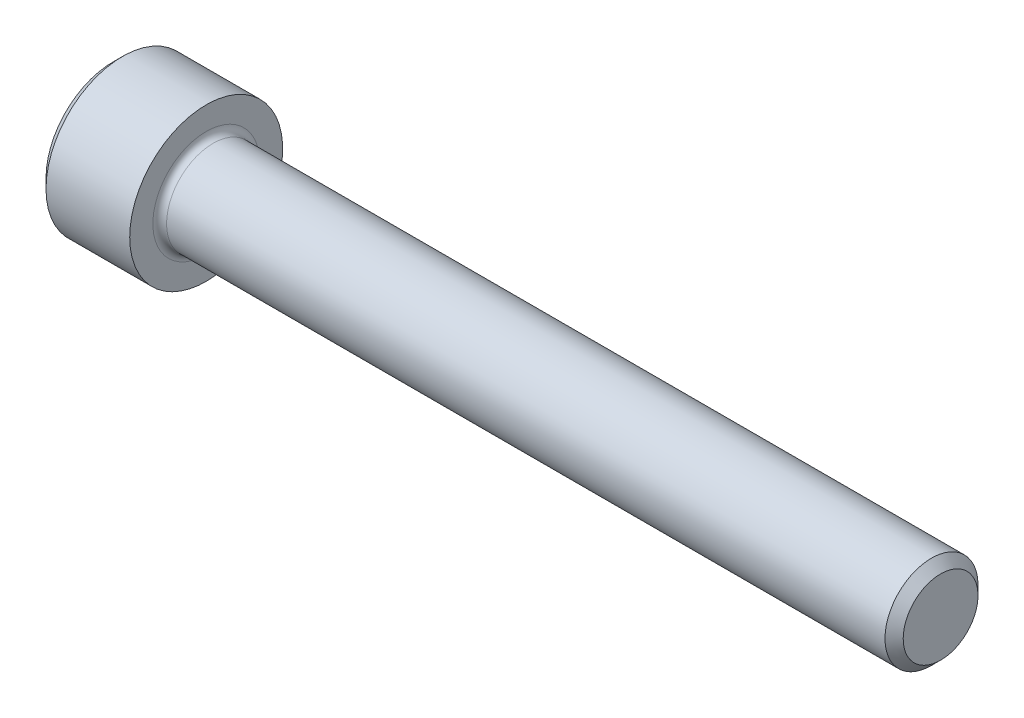
ISO-10303-21;
HEADER;
FILE_DESCRIPTION(('STEP AP214'),'2;1');
FILE_NAME('part.step','',(''),(''),'','','');
FILE_SCHEMA(('AUTOMOTIVE_DESIGN { 1 0 10303 214 1 1 1 1 }'));
ENDSEC;
DATA;
#1=APPLICATION_CONTEXT('core data for automotive mechanical design processes');
#2=APPLICATION_PROTOCOL_DEFINITION('international standard','automotive_design',2000,#1);
#3=PRODUCT_CONTEXT('',#1,'mechanical');
#4=PRODUCT('Part','Part','',(#3));
#5=PRODUCT_RELATED_PRODUCT_CATEGORY('part','',(#4));
#6=PRODUCT_DEFINITION_FORMATION('','',#4);
#7=PRODUCT_DEFINITION_CONTEXT('part definition',#1,'design');
#8=PRODUCT_DEFINITION('design','',#6,#7);
#9=PRODUCT_DEFINITION_SHAPE('','',#8);
#10=(LENGTH_UNIT() NAMED_UNIT(*) SI_UNIT(.MILLI.,.METRE.));
#11=(NAMED_UNIT(*) PLANE_ANGLE_UNIT() SI_UNIT($,.RADIAN.));
#12=(NAMED_UNIT(*) SI_UNIT($,.STERADIAN.) SOLID_ANGLE_UNIT());
#13=UNCERTAINTY_MEASURE_WITH_UNIT(LENGTH_MEASURE(1.E-05),#10,'distance_accuracy_value','');
#14=(GEOMETRIC_REPRESENTATION_CONTEXT(3) GLOBAL_UNCERTAINTY_ASSIGNED_CONTEXT((#13)) GLOBAL_UNIT_ASSIGNED_CONTEXT((#10,
#11,#12)) REPRESENTATION_CONTEXT('',''));
#15=CARTESIAN_POINT('',(0.,0.,0.));
#16=DIRECTION('',(0.,0.,1.));
#17=DIRECTION('',(1.,0.,0.));
#18=AXIS2_PLACEMENT_3D('',#15,#16,#17);
#19=CARTESIAN_POINT('',(2.286,0.,0.));
#20=DIRECTION('',(-1.,0.,0.));
#21=DIRECTION('',(0.,0.,1.));
#22=AXIS2_PLACEMENT_3D('',#19,#20,#21);
#23=CONICAL_SURFACE('',#22,1.98501,1.0471975511966);
#24=CARTESIAN_POINT('',(3.43204605784411,0.,0.));
#25=VERTEX_POINT('',#24);
#26=VERTEX_LOOP('',#25);
#27=FACE_BOUND('',#26,.T.);
#28=CARTESIAN_POINT('',(2.286,0.,0.));
#29=DIRECTION('',(-1.,0.,0.));
#30=DIRECTION('',(0.,0.,1.));
#31=AXIS2_PLACEMENT_3D('',#28,#29,#30);
#32=CIRCLE('',#31,1.98501);
#33=CARTESIAN_POINT('',(2.286,0.,1.98501));
#34=VERTEX_POINT('',#33);
#35=CARTESIAN_POINT('',(2.286,1.71906908676615,0.992505));
#36=VERTEX_POINT('',#35);
#37=EDGE_CURVE('E11',#34,#36,#32,.T.);
#38=ORIENTED_EDGE('',*,*,#37,.T.);
#39=CARTESIAN_POINT('',(2.286,0.,0.));
#40=DIRECTION('',(-1.,0.,0.));
#41=DIRECTION('',(0.,0.,1.));
#42=AXIS2_PLACEMENT_3D('',#39,#40,#41);
#43=CIRCLE('',#42,1.98501);
#44=CARTESIAN_POINT('',(2.286,1.71906908676615,-0.992505));
#45=VERTEX_POINT('',#44);
#46=EDGE_CURVE('E27',#36,#45,#43,.T.);
#47=ORIENTED_EDGE('',*,*,#46,.T.);
#48=CARTESIAN_POINT('',(2.286,0.,0.));
#49=DIRECTION('',(-1.,0.,0.));
#50=DIRECTION('',(0.,0.,1.));
#51=AXIS2_PLACEMENT_3D('',#48,#49,#50);
#52=CIRCLE('',#51,1.98501);
#53=CARTESIAN_POINT('',(2.286,0.,-1.98501));
#54=VERTEX_POINT('',#53);
#55=EDGE_CURVE('E191',#45,#54,#52,.T.);
#56=ORIENTED_EDGE('',*,*,#55,.T.);
#57=CARTESIAN_POINT('',(2.286,0.,0.));
#58=DIRECTION('',(-1.,0.,0.));
#59=DIRECTION('',(0.,0.,1.));
#60=AXIS2_PLACEMENT_3D('',#57,#58,#59);
#61=CIRCLE('',#60,1.98501);
#62=CARTESIAN_POINT('',(2.286,-1.71906908676615,-0.992505));
#63=VERTEX_POINT('',#62);
#64=EDGE_CURVE('E257',#54,#63,#61,.T.);
#65=ORIENTED_EDGE('',*,*,#64,.T.);
#66=CARTESIAN_POINT('',(2.286,0.,0.));
#67=DIRECTION('',(-1.,0.,0.));
#68=DIRECTION('',(0.,0.,1.));
#69=AXIS2_PLACEMENT_3D('',#66,#67,#68);
#70=CIRCLE('',#69,1.98501);
#71=CARTESIAN_POINT('',(2.286,-1.71906908676614,0.992505));
#72=VERTEX_POINT('',#71);
#73=EDGE_CURVE('E260',#63,#72,#70,.T.);
#74=ORIENTED_EDGE('',*,*,#73,.T.);
#75=CARTESIAN_POINT('',(2.286,0.,0.));
#76=DIRECTION('',(-1.,0.,0.));
#77=DIRECTION('',(0.,0.,1.));
#78=AXIS2_PLACEMENT_3D('',#75,#76,#77);
#79=CIRCLE('',#78,1.98501);
#80=EDGE_CURVE('E270',#72,#34,#79,.T.);
#81=ORIENTED_EDGE('',*,*,#80,.T.);
#82=EDGE_LOOP('',(#38,#47,#56,#65,#74,#81));
#83=FACE_BOUND('',#82,.T.);
#84=ADVANCED_FACE('F18',(#27,#83),#23,.F.);
#85=CARTESIAN_POINT('',(2.286,1.14604605784411,1.98501));
#86=DIRECTION('',(-1.,0.,0.));
#87=DIRECTION('',(0.,0.,1.));
#88=AXIS2_PLACEMENT_3D('',#85,#86,#87);
#89=PLANE('',#88);
#90=ORIENTED_EDGE('',*,*,#37,.F.);
#91=DIRECTION('',(0.,1.,0.));
#92=VECTOR('',#91,1.);
#93=CARTESIAN_POINT('',(2.286,-1.14604605784409,1.98501));
#94=LINE('',#93,#92);
#95=CARTESIAN_POINT('',(2.286,1.14604605784411,1.98501));
#96=VERTEX_POINT('',#95);
#97=EDGE_CURVE('E197',#34,#96,#94,.T.);
#98=ORIENTED_EDGE('',*,*,#97,.T.);
#99=DIRECTION('',(0.,-0.5,0.86602540378444));
#100=VECTOR('',#99,1.);
#101=CARTESIAN_POINT('',(2.286,2.29209211568821,0.));
#102=LINE('',#101,#100);
#103=EDGE_CURVE('E224',#36,#96,#102,.T.);
#104=ORIENTED_EDGE('',*,*,#103,.F.);
#105=EDGE_LOOP('',(#90,#98,#104));
#106=FACE_BOUND('',#105,.T.);
#107=ADVANCED_FACE('F20',(#106),#89,.T.);
#108=CARTESIAN_POINT('',(2.286,1.14604605784411,1.98501));
#109=DIRECTION('',(-1.,0.,0.));
#110=DIRECTION('',(0.,0.,1.));
#111=AXIS2_PLACEMENT_3D('',#108,#109,#110);
#112=PLANE('',#111);
#113=ORIENTED_EDGE('',*,*,#46,.F.);
#114=DIRECTION('',(0.,-0.5,0.86602540378444));
#115=VECTOR('',#114,1.);
#116=CARTESIAN_POINT('',(2.286,2.29209211568821,0.));
#117=LINE('',#116,#115);
#118=CARTESIAN_POINT('',(2.286,2.29209211568821,0.));
#119=VERTEX_POINT('',#118);
#120=EDGE_CURVE('E220',#119,#36,#117,.T.);
#121=ORIENTED_EDGE('',*,*,#120,.F.);
#122=DIRECTION('',(0.,-0.5,-0.866025403784438));
#123=VECTOR('',#122,1.);
#124=CARTESIAN_POINT('',(2.286,2.29209211568821,0.));
#125=LINE('',#124,#123);
#126=EDGE_CURVE('E266',#119,#45,#125,.T.);
#127=ORIENTED_EDGE('',*,*,#126,.T.);
#128=EDGE_LOOP('',(#113,#121,#127));
#129=FACE_BOUND('',#128,.T.);
#130=ADVANCED_FACE('F306',(#129),#112,.T.);
#131=CARTESIAN_POINT('',(2.286,1.14604605784411,1.98501));
#132=DIRECTION('',(-1.,0.,0.));
#133=DIRECTION('',(0.,0.,1.));
#134=AXIS2_PLACEMENT_3D('',#131,#132,#133);
#135=PLANE('',#134);
#136=ORIENTED_EDGE('',*,*,#55,.F.);
#137=DIRECTION('',(0.,-0.5,-0.866025403784438));
#138=VECTOR('',#137,1.);
#139=CARTESIAN_POINT('',(2.286,2.29209211568821,0.));
#140=LINE('',#139,#138);
#141=CARTESIAN_POINT('',(2.286,1.1460460578441,-1.98501));
#142=VERTEX_POINT('',#141);
#143=EDGE_CURVE('E263',#45,#142,#140,.T.);
#144=ORIENTED_EDGE('',*,*,#143,.T.);
#145=DIRECTION('',(0.,-1.,0.));
#146=VECTOR('',#145,1.);
#147=CARTESIAN_POINT('',(2.286,1.1460460578441,-1.98501));
#148=LINE('',#147,#146);
#149=EDGE_CURVE('E252',#142,#54,#148,.T.);
#150=ORIENTED_EDGE('',*,*,#149,.T.);
#151=EDGE_LOOP('',(#136,#144,#150));
#152=FACE_BOUND('',#151,.T.);
#153=ADVANCED_FACE('F287',(#152),#135,.T.);
#154=CARTESIAN_POINT('',(2.286,1.14604605784411,1.98501));
#155=DIRECTION('',(-1.,0.,0.));
#156=DIRECTION('',(0.,0.,1.));
#157=AXIS2_PLACEMENT_3D('',#154,#155,#156);
#158=PLANE('',#157);
#159=ORIENTED_EDGE('',*,*,#64,.F.);
#160=DIRECTION('',(0.,-1.,0.));
#161=VECTOR('',#160,1.);
#162=CARTESIAN_POINT('',(2.286,1.1460460578441,-1.98501));
#163=LINE('',#162,#161);
#164=CARTESIAN_POINT('',(2.286,-1.1460460578441,-1.98501));
#165=VERTEX_POINT('',#164);
#166=EDGE_CURVE('E249',#54,#165,#163,.T.);
#167=ORIENTED_EDGE('',*,*,#166,.T.);
#168=DIRECTION('',(0.,0.5,-0.86602540378444));
#169=VECTOR('',#168,1.);
#170=CARTESIAN_POINT('',(2.286,-2.2920921156882,0.));
#171=LINE('',#170,#169);
#172=EDGE_CURVE('E242',#63,#165,#171,.T.);
#173=ORIENTED_EDGE('',*,*,#172,.F.);
#174=EDGE_LOOP('',(#159,#167,#173));
#175=FACE_BOUND('',#174,.T.);
#176=ADVANCED_FACE('F283',(#175),#158,.T.);
#177=CARTESIAN_POINT('',(2.286,1.14604605784411,1.98501));
#178=DIRECTION('',(-1.,0.,0.));
#179=DIRECTION('',(0.,0.,1.));
#180=AXIS2_PLACEMENT_3D('',#177,#178,#179);
#181=PLANE('',#180);
#182=ORIENTED_EDGE('',*,*,#73,.F.);
#183=DIRECTION('',(0.,0.5,-0.86602540378444));
#184=VECTOR('',#183,1.);
#185=CARTESIAN_POINT('',(2.286,-2.2920921156882,0.));
#186=LINE('',#185,#184);
#187=CARTESIAN_POINT('',(2.286,-2.2920921156882,0.));
#188=VERTEX_POINT('',#187);
#189=EDGE_CURVE('E214',#188,#63,#186,.T.);
#190=ORIENTED_EDGE('',*,*,#189,.F.);
#191=DIRECTION('',(0.,-0.5,-0.866025403784438));
#192=VECTOR('',#191,1.);
#193=CARTESIAN_POINT('',(2.286,-1.14604605784409,1.98501));
#194=LINE('',#193,#192);
#195=EDGE_CURVE('E215',#72,#188,#194,.T.);
#196=ORIENTED_EDGE('',*,*,#195,.F.);
#197=EDGE_LOOP('',(#182,#190,#196));
#198=FACE_BOUND('',#197,.T.);
#199=ADVANCED_FACE('F298',(#198),#181,.T.);
#200=CARTESIAN_POINT('',(2.286,1.14604605784411,1.98501));
#201=DIRECTION('',(-1.,0.,0.));
#202=DIRECTION('',(0.,0.,1.));
#203=AXIS2_PLACEMENT_3D('',#200,#201,#202);
#204=PLANE('',#203);
#205=ORIENTED_EDGE('',*,*,#80,.F.);
#206=DIRECTION('',(0.,-0.5,-0.866025403784438));
#207=VECTOR('',#206,1.);
#208=CARTESIAN_POINT('',(2.286,-1.14604605784409,1.98501));
#209=LINE('',#208,#207);
#210=CARTESIAN_POINT('',(2.286,-1.14604605784409,1.98501));
#211=VERTEX_POINT('',#210);
#212=EDGE_CURVE('E155',#211,#72,#209,.T.);
#213=ORIENTED_EDGE('',*,*,#212,.F.);
#214=DIRECTION('',(0.,1.,0.));
#215=VECTOR('',#214,1.);
#216=CARTESIAN_POINT('',(2.286,-1.14604605784409,1.98501));
#217=LINE('',#216,#215);
#218=EDGE_CURVE('E151',#211,#34,#217,.T.);
#219=ORIENTED_EDGE('',*,*,#218,.T.);
#220=EDGE_LOOP('',(#205,#213,#219));
#221=FACE_BOUND('',#220,.T.);
#222=ADVANCED_FACE('F301',(#221),#204,.T.);
#223=CARTESIAN_POINT('',(2.286,2.29209211568821,0.));
#224=DIRECTION('',(0.,0.866025403784438,-0.5));
#225=DIRECTION('',(-1.,0.,0.));
#226=AXIS2_PLACEMENT_3D('',#223,#224,#225);
#227=PLANE('',#226);
#228=DIRECTION('',(0.,-0.5,-0.866025403784438));
#229=VECTOR('',#228,1.);
#230=CARTESIAN_POINT('',(0.,2.29209211568821,0.));
#231=LINE('',#230,#229);
#232=CARTESIAN_POINT('',(0.,2.29209211568821,0.));
#233=VERTEX_POINT('',#232);
#234=CARTESIAN_POINT('',(0.,1.1460460578441,-1.98501));
#235=VERTEX_POINT('',#234);
#236=EDGE_CURVE('E198',#233,#235,#231,.T.);
#237=ORIENTED_EDGE('',*,*,#236,.T.);
#238=DIRECTION('',(-1.,0.,0.));
#239=VECTOR('',#238,1.);
#240=CARTESIAN_POINT('',(2.286,1.1460460578441,-1.98501));
#241=LINE('',#240,#239);
#242=EDGE_CURVE('E256',#142,#235,#241,.T.);
#243=ORIENTED_EDGE('',*,*,#242,.F.);
#244=ORIENTED_EDGE('',*,*,#143,.F.);
#245=ORIENTED_EDGE('',*,*,#126,.F.);
#246=DIRECTION('',(-1.,0.,0.));
#247=VECTOR('',#246,1.);
#248=CARTESIAN_POINT('',(2.286,2.29209211568821,0.));
#249=LINE('',#248,#247);
#250=EDGE_CURVE('E211',#119,#233,#249,.T.);
#251=ORIENTED_EDGE('',*,*,#250,.T.);
#252=EDGE_LOOP('',(#237,#243,#244,#245,#251));
#253=FACE_BOUND('',#252,.T.);
#254=ADVANCED_FACE('F309',(#253),#227,.F.);
#255=CARTESIAN_POINT('',(2.286,1.1460460578441,-1.98501));
#256=DIRECTION('',(0.,0.,-1.));
#257=DIRECTION('',(0.,-1.,0.));
#258=AXIS2_PLACEMENT_3D('',#255,#256,#257);
#259=PLANE('',#258);
#260=DIRECTION('',(0.,-1.,0.));
#261=VECTOR('',#260,1.);
#262=CARTESIAN_POINT('',(0.,1.1460460578441,-1.98501));
#263=LINE('',#262,#261);
#264=CARTESIAN_POINT('',(0.,-1.1460460578441,-1.98501));
#265=VERTEX_POINT('',#264);
#266=EDGE_CURVE('E203',#235,#265,#263,.T.);
#267=ORIENTED_EDGE('',*,*,#266,.T.);
#268=DIRECTION('',(-1.,0.,0.));
#269=VECTOR('',#268,1.);
#270=CARTESIAN_POINT('',(2.286,-1.1460460578441,-1.98501));
#271=LINE('',#270,#269);
#272=EDGE_CURVE('E246',#165,#265,#271,.T.);
#273=ORIENTED_EDGE('',*,*,#272,.F.);
#274=ORIENTED_EDGE('',*,*,#166,.F.);
#275=ORIENTED_EDGE('',*,*,#149,.F.);
#276=ORIENTED_EDGE('',*,*,#242,.T.);
#277=EDGE_LOOP('',(#267,#273,#274,#275,#276));
#278=FACE_BOUND('',#277,.T.);
#279=ADVANCED_FACE('F292',(#278),#259,.F.);
#280=CARTESIAN_POINT('',(2.286,-2.2920921156882,0.));
#281=DIRECTION('',(0.,0.866025403784439,0.5));
#282=DIRECTION('',(1.,0.,0.));
#283=AXIS2_PLACEMENT_3D('',#280,#281,#282);
#284=PLANE('',#283);
#285=DIRECTION('',(0.,0.5,-0.86602540378444));
#286=VECTOR('',#285,1.);
#287=CARTESIAN_POINT('',(0.,-2.2920921156882,0.));
#288=LINE('',#287,#286);
#289=CARTESIAN_POINT('',(0.,-2.2920921156882,0.));
#290=VERTEX_POINT('',#289);
#291=EDGE_CURVE('E167',#290,#265,#288,.T.);
#292=ORIENTED_EDGE('',*,*,#291,.F.);
#293=DIRECTION('',(-1.,0.,0.));
#294=VECTOR('',#293,1.);
#295=CARTESIAN_POINT('',(2.286,-2.2920921156882,0.));
#296=LINE('',#295,#294);
#297=EDGE_CURVE('E162',#188,#290,#296,.T.);
#298=ORIENTED_EDGE('',*,*,#297,.F.);
#299=ORIENTED_EDGE('',*,*,#189,.T.);
#300=ORIENTED_EDGE('',*,*,#172,.T.);
#301=ORIENTED_EDGE('',*,*,#272,.T.);
#302=EDGE_LOOP('',(#292,#298,#299,#300,#301));
#303=FACE_BOUND('',#302,.T.);
#304=ADVANCED_FACE('F295',(#303),#284,.T.);
#305=CARTESIAN_POINT('',(2.286,-1.14604605784409,1.98501));
#306=DIRECTION('',(0.,0.866025403784438,-0.5));
#307=DIRECTION('',(-1.,0.,0.));
#308=AXIS2_PLACEMENT_3D('',#305,#306,#307);
#309=PLANE('',#308);
#310=DIRECTION('',(0.,-0.5,-0.866025403784438));
#311=VECTOR('',#310,1.);
#312=CARTESIAN_POINT('',(0.,-1.14604605784409,1.98501));
#313=LINE('',#312,#311);
#314=CARTESIAN_POINT('',(0.,-1.14604605784409,1.98501));
#315=VERTEX_POINT('',#314);
#316=EDGE_CURVE('E158',#315,#290,#313,.T.);
#317=ORIENTED_EDGE('',*,*,#316,.F.);
#318=DIRECTION('',(-1.,0.,0.));
#319=VECTOR('',#318,1.);
#320=CARTESIAN_POINT('',(2.286,-1.14604605784409,1.98501));
#321=LINE('',#320,#319);
#322=EDGE_CURVE('E142',#211,#315,#321,.T.);
#323=ORIENTED_EDGE('',*,*,#322,.F.);
#324=ORIENTED_EDGE('',*,*,#212,.T.);
#325=ORIENTED_EDGE('',*,*,#195,.T.);
#326=ORIENTED_EDGE('',*,*,#297,.T.);
#327=EDGE_LOOP('',(#317,#323,#324,#325,#326));
#328=FACE_BOUND('',#327,.T.);
#329=ADVANCED_FACE('F159',(#328),#309,.T.);
#330=CARTESIAN_POINT('',(2.286,-1.14604605784409,1.98501));
#331=DIRECTION('',(0.,0.,1.));
#332=DIRECTION('',(0.,-1.,0.));
#333=AXIS2_PLACEMENT_3D('',#330,#331,#332);
#334=PLANE('',#333);
#335=DIRECTION('',(0.,1.,0.));
#336=VECTOR('',#335,1.);
#337=CARTESIAN_POINT('',(0.,-1.14604605784409,1.98501));
#338=LINE('',#337,#336);
#339=CARTESIAN_POINT('',(0.,1.14604605784411,1.98501));
#340=VERTEX_POINT('',#339);
#341=EDGE_CURVE('E147',#315,#340,#338,.T.);
#342=ORIENTED_EDGE('',*,*,#341,.T.);
#343=DIRECTION('',(-1.,0.,0.));
#344=VECTOR('',#343,1.);
#345=CARTESIAN_POINT('',(2.286,1.14604605784411,1.98501));
#346=LINE('',#345,#344);
#347=EDGE_CURVE('E232',#96,#340,#346,.T.);
#348=ORIENTED_EDGE('',*,*,#347,.F.);
#349=ORIENTED_EDGE('',*,*,#97,.F.);
#350=ORIENTED_EDGE('',*,*,#218,.F.);
#351=ORIENTED_EDGE('',*,*,#322,.T.);
#352=EDGE_LOOP('',(#342,#348,#349,#350,#351));
#353=FACE_BOUND('',#352,.T.);
#354=ADVANCED_FACE('F144',(#353),#334,.F.);
#355=CARTESIAN_POINT('',(2.286,2.29209211568821,0.));
#356=DIRECTION('',(0.,-0.86602540378444,-0.5));
#357=DIRECTION('',(0.,0.5,-0.86602540378444));
#358=AXIS2_PLACEMENT_3D('',#355,#356,#357);
#359=PLANE('',#358);
#360=DIRECTION('',(0.,-0.5,0.86602540378444));
#361=VECTOR('',#360,1.);
#362=CARTESIAN_POINT('',(0.,2.29209211568821,0.));
#363=LINE('',#362,#361);
#364=EDGE_CURVE('E173',#233,#340,#363,.T.);
#365=ORIENTED_EDGE('',*,*,#364,.F.);
#366=ORIENTED_EDGE('',*,*,#250,.F.);
#367=ORIENTED_EDGE('',*,*,#120,.T.);
#368=ORIENTED_EDGE('',*,*,#103,.T.);
#369=ORIENTED_EDGE('',*,*,#347,.T.);
#370=EDGE_LOOP('',(#365,#366,#367,#368,#369));
#371=FACE_BOUND('',#370,.T.);
#372=ADVANCED_FACE('F367',(#371),#359,.T.);
#373=CARTESIAN_POINT('',(5.1816,0.,0.));
#374=DIRECTION('',(1.,0.,0.));
#375=DIRECTION('',(0.,0.,-1.));
#376=AXIS2_PLACEMENT_3D('',#373,#374,#375);
#377=TOROIDAL_SURFACE('',#376,2.7686,0.3556);
#378=CARTESIAN_POINT('',(5.1816,0.,0.));
#379=DIRECTION('',(1.,0.,0.));
#380=DIRECTION('',(0.,0.,-1.));
#381=AXIS2_PLACEMENT_3D('',#378,#379,#380);
#382=CIRCLE('',#381,2.413);
#383=CARTESIAN_POINT('',(5.1816,0.,-2.413));
#384=VERTEX_POINT('',#383);
#385=EDGE_CURVE('E187',#384,#384,#382,.T.);
#386=ORIENTED_EDGE('',*,*,#385,.F.);
#387=EDGE_LOOP('',(#386));
#388=FACE_BOUND('',#387,.T.);
#389=CARTESIAN_POINT('',(4.826,0.,0.));
#390=DIRECTION('',(-1.,0.,0.));
#391=DIRECTION('',(0.,0.,-1.));
#392=AXIS2_PLACEMENT_3D('',#389,#390,#391);
#393=CIRCLE('',#392,2.7686);
#394=CARTESIAN_POINT('',(4.826,0.,-2.7686));
#395=VERTEX_POINT('',#394);
#396=EDGE_CURVE('E188',#395,#395,#393,.T.);
#397=ORIENTED_EDGE('',*,*,#396,.F.);
#398=EDGE_LOOP('',(#397));
#399=FACE_BOUND('',#398,.T.);
#400=ADVANCED_FACE('F364',(#388,#399),#377,.F.);
#401=CARTESIAN_POINT('',(42.926,1.94056,0.));
#402=DIRECTION('',(1.,0.,0.));
#403=DIRECTION('',(0.,1.,0.));
#404=AXIS2_PLACEMENT_3D('',#401,#402,#403);
#405=PLANE('',#404);
#406=CARTESIAN_POINT('',(42.926,0.,0.));
#407=DIRECTION('',(-1.,0.,0.));
#408=DIRECTION('',(0.,0.,1.));
#409=AXIS2_PLACEMENT_3D('',#406,#407,#408);
#410=CIRCLE('',#409,1.94056);
#411=CARTESIAN_POINT('',(42.926,0.,1.94056));
#412=VERTEX_POINT('',#411);
#413=EDGE_CURVE('E208',#412,#412,#410,.T.);
#414=ORIENTED_EDGE('',*,*,#413,.F.);
#415=EDGE_LOOP('',(#414));
#416=FACE_BOUND('',#415,.T.);
#417=ADVANCED_FACE('F357',(#416),#405,.T.);
#418=CARTESIAN_POINT('',(42.926,0.,0.));
#419=DIRECTION('',(-1.,0.,0.));
#420=DIRECTION('',(0.,0.,1.));
#421=AXIS2_PLACEMENT_3D('',#418,#419,#420);
#422=CONICAL_SURFACE('',#421,1.94056,0.785398163397412);
#423=ORIENTED_EDGE('',*,*,#413,.T.);
#424=EDGE_LOOP('',(#423));
#425=FACE_BOUND('',#424,.T.);
#426=CARTESIAN_POINT('',(42.45356,0.,0.));
#427=DIRECTION('',(-1.,0.,0.));
#428=DIRECTION('',(0.,0.,1.));
#429=AXIS2_PLACEMENT_3D('',#426,#427,#428);
#430=CIRCLE('',#429,2.413);
#431=CARTESIAN_POINT('',(42.45356,0.,2.413));
#432=VERTEX_POINT('',#431);
#433=EDGE_CURVE('E184',#432,#432,#430,.T.);
#434=ORIENTED_EDGE('',*,*,#433,.F.);
#435=EDGE_LOOP('',(#434));
#436=FACE_BOUND('',#435,.T.);
#437=ADVANCED_FACE('F351',(#425,#436),#422,.T.);
#438=CARTESIAN_POINT('',(-31.75,0.,0.));
#439=DIRECTION('',(-1.,0.,0.));
#440=DIRECTION('',(0.,0.,1.));
#441=AXIS2_PLACEMENT_3D('',#438,#439,#440);
#442=CYLINDRICAL_SURFACE('',#441,2.413);
#443=ORIENTED_EDGE('',*,*,#385,.T.);
#444=EDGE_LOOP('',(#443));
#445=FACE_BOUND('',#444,.T.);
#446=ORIENTED_EDGE('',*,*,#433,.T.);
#447=EDGE_LOOP('',(#446));
#448=FACE_BOUND('',#447,.T.);
#449=ADVANCED_FACE('F335',(#445,#448),#442,.T.);
#450=CARTESIAN_POINT('',(4.826,3.96875,0.));
#451=DIRECTION('',(1.,0.,0.));
#452=DIRECTION('',(0.,1.,0.));
#453=AXIS2_PLACEMENT_3D('',#450,#451,#452);
#454=PLANE('',#453);
#455=ORIENTED_EDGE('',*,*,#396,.T.);
#456=EDGE_LOOP('',(#455));
#457=FACE_BOUND('',#456,.T.);
#458=CARTESIAN_POINT('',(4.826,0.,0.));
#459=DIRECTION('',(-1.,0.,0.));
#460=DIRECTION('',(0.,0.,1.));
#461=AXIS2_PLACEMENT_3D('',#458,#459,#460);
#462=CIRCLE('',#461,3.96875);
#463=CARTESIAN_POINT('',(4.826,0.,3.96875));
#464=VERTEX_POINT('',#463);
#465=EDGE_CURVE('E193',#464,#464,#462,.T.);
#466=ORIENTED_EDGE('',*,*,#465,.F.);
#467=EDGE_LOOP('',(#466));
#468=FACE_BOUND('',#467,.T.);
#469=ADVANCED_FACE('F327',(#457,#468),#454,.T.);
#470=CARTESIAN_POINT('',(-31.75,0.,0.));
#471=DIRECTION('',(-1.,0.,0.));
#472=DIRECTION('',(0.,0.,1.));
#473=AXIS2_PLACEMENT_3D('',#470,#471,#472);
#474=CYLINDRICAL_SURFACE('',#473,3.96875);
#475=ORIENTED_EDGE('',*,*,#465,.T.);
#476=EDGE_LOOP('',(#475));
#477=FACE_BOUND('',#476,.T.);
#478=CARTESIAN_POINT('',(0.4826,0.,0.));
#479=DIRECTION('',(-1.,0.,0.));
#480=DIRECTION('',(0.,0.,1.));
#481=AXIS2_PLACEMENT_3D('',#478,#479,#480);
#482=CIRCLE('',#481,3.96875);
#483=CARTESIAN_POINT('',(0.4826,0.,3.96875));
#484=VERTEX_POINT('',#483);
#485=EDGE_CURVE('E202',#484,#484,#482,.T.);
#486=ORIENTED_EDGE('',*,*,#485,.F.);
#487=EDGE_LOOP('',(#486));
#488=FACE_BOUND('',#487,.T.);
#489=ADVANCED_FACE('F322',(#477,#488),#474,.T.);
#490=CARTESIAN_POINT('',(0.,0.,0.));
#491=DIRECTION('',(1.,0.,0.));
#492=DIRECTION('',(0.,0.,-1.));
#493=AXIS2_PLACEMENT_3D('',#490,#491,#492);
#494=CONICAL_SURFACE('',#493,3.48615,0.78539816339745);
#495=CARTESIAN_POINT('',(0.,0.,0.));
#496=DIRECTION('',(-1.,0.,0.));
#497=DIRECTION('',(0.,0.,1.));
#498=AXIS2_PLACEMENT_3D('',#495,#496,#497);
#499=CIRCLE('',#498,3.48615);
#500=CARTESIAN_POINT('',(0.,0.,3.48615));
#501=VERTEX_POINT('',#500);
#502=EDGE_CURVE('E180',#501,#501,#499,.T.);
#503=ORIENTED_EDGE('',*,*,#502,.F.);
#504=EDGE_LOOP('',(#503));
#505=FACE_BOUND('',#504,.T.);
#506=ORIENTED_EDGE('',*,*,#485,.T.);
#507=EDGE_LOOP('',(#506));
#508=FACE_BOUND('',#507,.T.);
#509=ADVANCED_FACE('F319',(#505,#508),#494,.T.);
#510=CARTESIAN_POINT('',(0.,0.,0.));
#511=DIRECTION('',(-1.,0.,0.));
#512=DIRECTION('',(0.,0.,1.));
#513=AXIS2_PLACEMENT_3D('',#510,#511,#512);
#514=PLANE('',#513);
#515=ORIENTED_EDGE('',*,*,#364,.T.);
#516=ORIENTED_EDGE('',*,*,#341,.F.);
#517=ORIENTED_EDGE('',*,*,#316,.T.);
#518=ORIENTED_EDGE('',*,*,#291,.T.);
#519=ORIENTED_EDGE('',*,*,#266,.F.);
#520=ORIENTED_EDGE('',*,*,#236,.F.);
#521=EDGE_LOOP('',(#515,#516,#517,#518,#519,#520));
#522=FACE_BOUND('',#521,.T.);
#523=ORIENTED_EDGE('',*,*,#502,.T.);
#524=EDGE_LOOP('',(#523));
#525=FACE_BOUND('',#524,.T.);
#526=ADVANCED_FACE('F169',(#522,#525),#514,.T.);
#527=CLOSED_SHELL('',(#84,#107,#130,#153,#176,#199,#222,#254,#279,#304,#329,#354,#372,#400,#417,
#437,#449,#469,#489,#509,#526));
#528=MANIFOLD_SOLID_BREP('B1',#527);
#529=ADVANCED_BREP_SHAPE_REPRESENTATION('',(#18,#528),#14);
#530=SHAPE_DEFINITION_REPRESENTATION(#9,#529);
ENDSEC;
END-ISO-10303-21;
